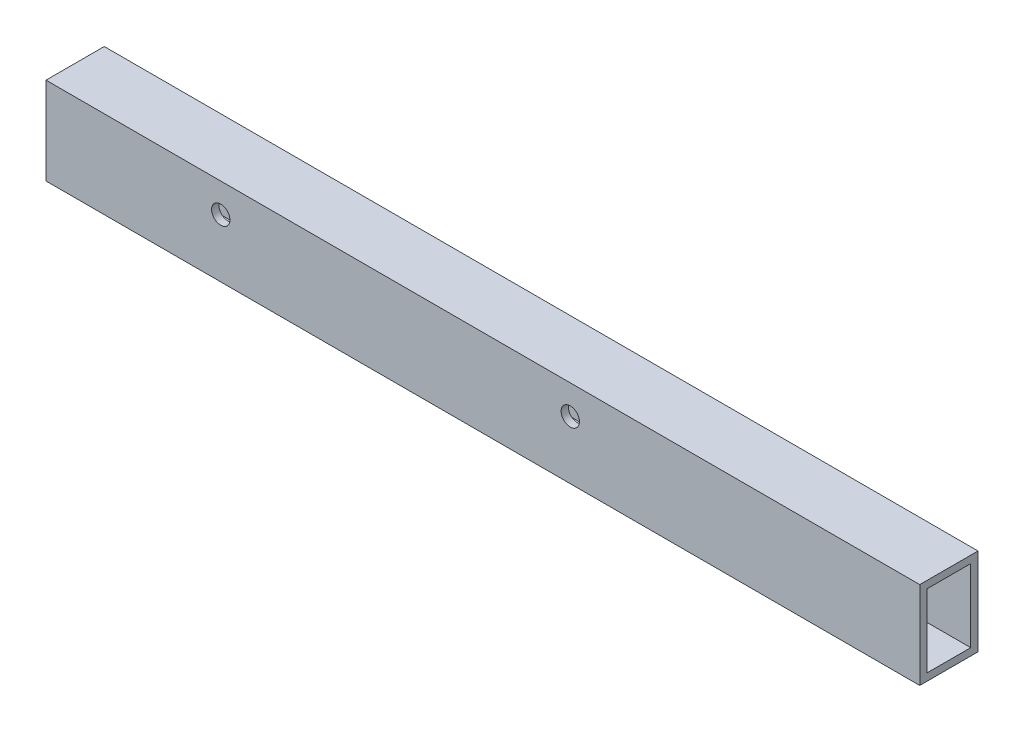
ISO-10303-21;
HEADER;
FILE_DESCRIPTION(('STEP AP214'),'2;1');
FILE_NAME('part.step','',(''),(''),'','','');
FILE_SCHEMA(('AUTOMOTIVE_DESIGN { 1 0 10303 214 1 1 1 1 }'));
ENDSEC;
DATA;
#1=APPLICATION_CONTEXT('core data for automotive mechanical design processes');
#2=APPLICATION_PROTOCOL_DEFINITION('international standard','automotive_design',2000,#1);
#3=PRODUCT_CONTEXT('',#1,'mechanical');
#4=PRODUCT('Part','Part','',(#3));
#5=PRODUCT_RELATED_PRODUCT_CATEGORY('part','',(#4));
#6=PRODUCT_DEFINITION_FORMATION('','',#4);
#7=PRODUCT_DEFINITION_CONTEXT('part definition',#1,'design');
#8=PRODUCT_DEFINITION('design','',#6,#7);
#9=PRODUCT_DEFINITION_SHAPE('','',#8);
#10=(LENGTH_UNIT() NAMED_UNIT(*) SI_UNIT(.MILLI.,.METRE.));
#11=(NAMED_UNIT(*) PLANE_ANGLE_UNIT() SI_UNIT($,.RADIAN.));
#12=(NAMED_UNIT(*) SI_UNIT($,.STERADIAN.) SOLID_ANGLE_UNIT());
#13=UNCERTAINTY_MEASURE_WITH_UNIT(LENGTH_MEASURE(1.E-05),#10,'distance_accuracy_value','');
#14=(GEOMETRIC_REPRESENTATION_CONTEXT(3) GLOBAL_UNCERTAINTY_ASSIGNED_CONTEXT((#13)) GLOBAL_UNIT_ASSIGNED_CONTEXT((#10,
#11,#12)) REPRESENTATION_CONTEXT('',''));
#15=CARTESIAN_POINT('',(0.,0.,0.));
#16=DIRECTION('',(0.,0.,1.));
#17=DIRECTION('',(1.,0.,0.));
#18=AXIS2_PLACEMENT_3D('',#15,#16,#17);
#19=CARTESIAN_POINT('',(381.,0.,0.));
#20=DIRECTION('',(-1.,0.,0.));
#21=DIRECTION('',(0.,0.,1.));
#22=AXIS2_PLACEMENT_3D('',#19,#20,#21);
#23=PLANE('',#22);
#24=DIRECTION('',(0.,1.,0.));
#25=VECTOR('',#24,1.);
#26=CARTESIAN_POINT('',(381.,-19.05,-12.7));
#27=LINE('',#26,#25);
#28=CARTESIAN_POINT('',(381.,-19.05,-12.7));
#29=VERTEX_POINT('',#28);
#30=CARTESIAN_POINT('',(381.,19.05,-12.7));
#31=VERTEX_POINT('',#30);
#32=EDGE_CURVE('E156',#29,#31,#27,.T.);
#33=ORIENTED_EDGE('',*,*,#32,.T.);
#34=DIRECTION('',(0.,0.,1.));
#35=VECTOR('',#34,1.);
#36=CARTESIAN_POINT('',(381.,19.05,12.7));
#37=LINE('',#36,#35);
#38=CARTESIAN_POINT('',(381.,19.05,12.7));
#39=VERTEX_POINT('',#38);
#40=EDGE_CURVE('E160',#31,#39,#37,.T.);
#41=ORIENTED_EDGE('',*,*,#40,.T.);
#42=DIRECTION('',(0.,-1.,0.));
#43=VECTOR('',#42,1.);
#44=CARTESIAN_POINT('',(381.,-19.05,12.7));
#45=LINE('',#44,#43);
#46=CARTESIAN_POINT('',(381.,-19.05,12.7));
#47=VERTEX_POINT('',#46);
#48=EDGE_CURVE('E164',#39,#47,#45,.T.);
#49=ORIENTED_EDGE('',*,*,#48,.T.);
#50=DIRECTION('',(0.,0.,-1.));
#51=VECTOR('',#50,1.);
#52=CARTESIAN_POINT('',(381.,-19.05,12.7));
#53=LINE('',#52,#51);
#54=EDGE_CURVE('E167',#47,#29,#53,.T.);
#55=ORIENTED_EDGE('',*,*,#54,.T.);
#56=EDGE_LOOP('',(#33,#41,#49,#55));
#57=FACE_BOUND('',#56,.T.);
#58=DIRECTION('',(0.,0.,-1.));
#59=VECTOR('',#58,1.);
#60=CARTESIAN_POINT('',(381.,-15.875,9.525));
#61=LINE('',#60,#59);
#62=CARTESIAN_POINT('',(381.,-15.875,9.525));
#63=VERTEX_POINT('',#62);
#64=CARTESIAN_POINT('',(381.,-15.875,-9.525));
#65=VERTEX_POINT('',#64);
#66=EDGE_CURVE('E106',#63,#65,#61,.T.);
#67=ORIENTED_EDGE('',*,*,#66,.F.);
#68=DIRECTION('',(0.,-1.,0.));
#69=VECTOR('',#68,1.);
#70=CARTESIAN_POINT('',(381.,-15.875,9.525));
#71=LINE('',#70,#69);
#72=CARTESIAN_POINT('',(381.,15.875,9.525));
#73=VERTEX_POINT('',#72);
#74=EDGE_CURVE('E132',#73,#63,#71,.T.);
#75=ORIENTED_EDGE('',*,*,#74,.F.);
#76=DIRECTION('',(0.,0.,1.));
#77=VECTOR('',#76,1.);
#78=CARTESIAN_POINT('',(381.,15.875,9.525));
#79=LINE('',#78,#77);
#80=CARTESIAN_POINT('',(381.,15.875,-9.525));
#81=VERTEX_POINT('',#80);
#82=EDGE_CURVE('E128',#81,#73,#79,.T.);
#83=ORIENTED_EDGE('',*,*,#82,.F.);
#84=DIRECTION('',(0.,1.,0.));
#85=VECTOR('',#84,1.);
#86=CARTESIAN_POINT('',(381.,-15.875,-9.525));
#87=LINE('',#86,#85);
#88=EDGE_CURVE('E115',#65,#81,#87,.T.);
#89=ORIENTED_EDGE('',*,*,#88,.F.);
#90=EDGE_LOOP('',(#67,#75,#83,#89));
#91=FACE_BOUND('',#90,.T.);
#92=ADVANCED_FACE('F38',(#57,#91),#23,.F.);
#93=CARTESIAN_POINT('',(0.,0.,0.));
#94=DIRECTION('',(-1.,0.,0.));
#95=DIRECTION('',(0.,0.,1.));
#96=AXIS2_PLACEMENT_3D('',#93,#94,#95);
#97=PLANE('',#96);
#98=DIRECTION('',(0.,1.,0.));
#99=VECTOR('',#98,1.);
#100=CARTESIAN_POINT('',(0.,-19.05,-12.7));
#101=LINE('',#100,#99);
#102=CARTESIAN_POINT('',(0.,-19.05,-12.7));
#103=VERTEX_POINT('',#102);
#104=CARTESIAN_POINT('',(0.,19.05,-12.7));
#105=VERTEX_POINT('',#104);
#106=EDGE_CURVE('E124',#103,#105,#101,.T.);
#107=ORIENTED_EDGE('',*,*,#106,.F.);
#108=DIRECTION('',(0.,0.,-1.));
#109=VECTOR('',#108,1.);
#110=CARTESIAN_POINT('',(0.,-19.05,12.7));
#111=LINE('',#110,#109);
#112=CARTESIAN_POINT('',(0.,-19.05,12.7));
#113=VERTEX_POINT('',#112);
#114=EDGE_CURVE('E161',#113,#103,#111,.T.);
#115=ORIENTED_EDGE('',*,*,#114,.F.);
#116=DIRECTION('',(0.,-1.,0.));
#117=VECTOR('',#116,1.);
#118=CARTESIAN_POINT('',(0.,-19.05,12.7));
#119=LINE('',#118,#117);
#120=CARTESIAN_POINT('',(0.,19.05,12.7));
#121=VERTEX_POINT('',#120);
#122=EDGE_CURVE('E177',#121,#113,#119,.T.);
#123=ORIENTED_EDGE('',*,*,#122,.F.);
#124=DIRECTION('',(0.,0.,1.));
#125=VECTOR('',#124,1.);
#126=CARTESIAN_POINT('',(0.,19.05,12.7));
#127=LINE('',#126,#125);
#128=EDGE_CURVE('E174',#105,#121,#127,.T.);
#129=ORIENTED_EDGE('',*,*,#128,.F.);
#130=EDGE_LOOP('',(#107,#115,#123,#129));
#131=FACE_BOUND('',#130,.T.);
#132=DIRECTION('',(0.,-1.,0.));
#133=VECTOR('',#132,1.);
#134=CARTESIAN_POINT('',(0.,-15.875,9.525));
#135=LINE('',#134,#133);
#136=CARTESIAN_POINT('',(0.,15.875,9.525));
#137=VERTEX_POINT('',#136);
#138=CARTESIAN_POINT('',(0.,-15.875,9.525));
#139=VERTEX_POINT('',#138);
#140=EDGE_CURVE('E116',#137,#139,#135,.T.);
#141=ORIENTED_EDGE('',*,*,#140,.T.);
#142=DIRECTION('',(0.,0.,-1.));
#143=VECTOR('',#142,1.);
#144=CARTESIAN_POINT('',(0.,-15.875,9.525));
#145=LINE('',#144,#143);
#146=CARTESIAN_POINT('',(0.,-15.875,-9.525));
#147=VERTEX_POINT('',#146);
#148=EDGE_CURVE('E64',#139,#147,#145,.T.);
#149=ORIENTED_EDGE('',*,*,#148,.T.);
#150=DIRECTION('',(0.,1.,0.));
#151=VECTOR('',#150,1.);
#152=CARTESIAN_POINT('',(0.,-15.875,-9.525));
#153=LINE('',#152,#151);
#154=CARTESIAN_POINT('',(0.,15.875,-9.525));
#155=VERTEX_POINT('',#154);
#156=EDGE_CURVE('E122',#147,#155,#153,.T.);
#157=ORIENTED_EDGE('',*,*,#156,.T.);
#158=DIRECTION('',(0.,0.,1.));
#159=VECTOR('',#158,1.);
#160=CARTESIAN_POINT('',(0.,15.875,9.525));
#161=LINE('',#160,#159);
#162=EDGE_CURVE('E143',#155,#137,#161,.T.);
#163=ORIENTED_EDGE('',*,*,#162,.T.);
#164=EDGE_LOOP('',(#141,#149,#157,#163));
#165=FACE_BOUND('',#164,.T.);
#166=ADVANCED_FACE('F237',(#131,#165),#97,.T.);
#167=CARTESIAN_POINT('',(381.,-19.05,-12.7));
#168=DIRECTION('',(0.,0.,1.));
#169=DIRECTION('',(1.,0.,0.));
#170=AXIS2_PLACEMENT_3D('',#167,#168,#169);
#171=PLANE('',#170);
#172=CARTESIAN_POINT('',(76.2,6.35,-12.7));
#173=DIRECTION('',(0.,0.,-1.));
#174=DIRECTION('',(-1.,0.,0.));
#175=AXIS2_PLACEMENT_3D('',#172,#173,#174);
#176=CIRCLE('',#175,4.00000000000001);
#177=CARTESIAN_POINT('',(72.2,6.35,-12.7));
#178=VERTEX_POINT('',#177);
#179=EDGE_CURVE('E203',#178,#178,#176,.T.);
#180=ORIENTED_EDGE('',*,*,#179,.F.);
#181=EDGE_LOOP('',(#180));
#182=FACE_BOUND('',#181,.T.);
#183=CARTESIAN_POINT('',(228.6,6.34999999999998,-12.7));
#184=DIRECTION('',(0.,0.,-1.));
#185=DIRECTION('',(-1.,0.,0.));
#186=AXIS2_PLACEMENT_3D('',#183,#184,#185);
#187=CIRCLE('',#186,3.99999999999999);
#188=CARTESIAN_POINT('',(224.6,6.34999999999998,-12.7));
#189=VERTEX_POINT('',#188);
#190=EDGE_CURVE('E215',#189,#189,#187,.T.);
#191=ORIENTED_EDGE('',*,*,#190,.F.);
#192=EDGE_LOOP('',(#191));
#193=FACE_BOUND('',#192,.T.);
#194=ORIENTED_EDGE('',*,*,#106,.T.);
#195=DIRECTION('',(-1.,0.,0.));
#196=VECTOR('',#195,1.);
#197=CARTESIAN_POINT('',(381.,19.05,-12.7));
#198=LINE('',#197,#196);
#199=EDGE_CURVE('E11',#31,#105,#198,.T.);
#200=ORIENTED_EDGE('',*,*,#199,.F.);
#201=ORIENTED_EDGE('',*,*,#32,.F.);
#202=DIRECTION('',(-1.,0.,0.));
#203=VECTOR('',#202,1.);
#204=CARTESIAN_POINT('',(381.,-19.05,-12.7));
#205=LINE('',#204,#203);
#206=EDGE_CURVE('E170',#29,#103,#205,.T.);
#207=ORIENTED_EDGE('',*,*,#206,.T.);
#208=EDGE_LOOP('',(#194,#200,#201,#207));
#209=FACE_BOUND('',#208,.T.);
#210=ADVANCED_FACE('F40',(#182,#193,#209),#171,.F.);
#211=CARTESIAN_POINT('',(381.,19.05,12.7));
#212=DIRECTION('',(0.,-1.,0.));
#213=DIRECTION('',(0.,0.,-1.));
#214=AXIS2_PLACEMENT_3D('',#211,#212,#213);
#215=PLANE('',#214);
#216=ORIENTED_EDGE('',*,*,#128,.T.);
#217=DIRECTION('',(-1.,0.,0.));
#218=VECTOR('',#217,1.);
#219=CARTESIAN_POINT('',(381.,19.05,12.7));
#220=LINE('',#219,#218);
#221=EDGE_CURVE('E48',#39,#121,#220,.T.);
#222=ORIENTED_EDGE('',*,*,#221,.F.);
#223=ORIENTED_EDGE('',*,*,#40,.F.);
#224=ORIENTED_EDGE('',*,*,#199,.T.);
#225=EDGE_LOOP('',(#216,#222,#223,#224));
#226=FACE_BOUND('',#225,.T.);
#227=ADVANCED_FACE('F264',(#226),#215,.F.);
#228=CARTESIAN_POINT('',(381.,-19.05,12.7));
#229=DIRECTION('',(0.,0.,-1.));
#230=DIRECTION('',(-1.,0.,0.));
#231=AXIS2_PLACEMENT_3D('',#228,#229,#230);
#232=PLANE('',#231);
#233=CARTESIAN_POINT('',(76.2,6.35,12.7));
#234=DIRECTION('',(0.,0.,-1.));
#235=DIRECTION('',(-1.,0.,0.));
#236=AXIS2_PLACEMENT_3D('',#233,#234,#235);
#237=CIRCLE('',#236,4.00000000000001);
#238=CARTESIAN_POINT('',(72.2,6.35,12.7));
#239=VERTEX_POINT('',#238);
#240=EDGE_CURVE('E195',#239,#239,#237,.T.);
#241=ORIENTED_EDGE('',*,*,#240,.T.);
#242=EDGE_LOOP('',(#241));
#243=FACE_BOUND('',#242,.T.);
#244=CARTESIAN_POINT('',(228.6,6.34999999999998,12.7));
#245=DIRECTION('',(0.,0.,-1.));
#246=DIRECTION('',(-1.,0.,0.));
#247=AXIS2_PLACEMENT_3D('',#244,#245,#246);
#248=CIRCLE('',#247,3.99999999999999);
#249=CARTESIAN_POINT('',(224.6,6.34999999999998,12.7));
#250=VERTEX_POINT('',#249);
#251=EDGE_CURVE('E209',#250,#250,#248,.T.);
#252=ORIENTED_EDGE('',*,*,#251,.T.);
#253=EDGE_LOOP('',(#252));
#254=FACE_BOUND('',#253,.T.);
#255=ORIENTED_EDGE('',*,*,#122,.T.);
#256=DIRECTION('',(-1.,0.,0.));
#257=VECTOR('',#256,1.);
#258=CARTESIAN_POINT('',(381.,-19.05,12.7));
#259=LINE('',#258,#257);
#260=EDGE_CURVE('E185',#47,#113,#259,.T.);
#261=ORIENTED_EDGE('',*,*,#260,.F.);
#262=ORIENTED_EDGE('',*,*,#48,.F.);
#263=ORIENTED_EDGE('',*,*,#221,.T.);
#264=EDGE_LOOP('',(#255,#261,#262,#263));
#265=FACE_BOUND('',#264,.T.);
#266=ADVANCED_FACE('F261',(#243,#254,#265),#232,.F.);
#267=CARTESIAN_POINT('',(381.,-19.05,12.7));
#268=DIRECTION('',(0.,1.,0.));
#269=DIRECTION('',(0.,0.,1.));
#270=AXIS2_PLACEMENT_3D('',#267,#268,#269);
#271=PLANE('',#270);
#272=ORIENTED_EDGE('',*,*,#114,.T.);
#273=ORIENTED_EDGE('',*,*,#206,.F.);
#274=ORIENTED_EDGE('',*,*,#54,.F.);
#275=ORIENTED_EDGE('',*,*,#260,.T.);
#276=EDGE_LOOP('',(#272,#273,#274,#275));
#277=FACE_BOUND('',#276,.T.);
#278=ADVANCED_FACE('F258',(#277),#271,.F.);
#279=CARTESIAN_POINT('',(381.,-15.875,9.525));
#280=DIRECTION('',(0.,1.,0.));
#281=DIRECTION('',(0.,0.,1.));
#282=AXIS2_PLACEMENT_3D('',#279,#280,#281);
#283=PLANE('',#282);
#284=ORIENTED_EDGE('',*,*,#148,.F.);
#285=DIRECTION('',(-1.,0.,0.));
#286=VECTOR('',#285,1.);
#287=CARTESIAN_POINT('',(381.,-15.875,9.525));
#288=LINE('',#287,#286);
#289=EDGE_CURVE('E110',#63,#139,#288,.T.);
#290=ORIENTED_EDGE('',*,*,#289,.F.);
#291=ORIENTED_EDGE('',*,*,#66,.T.);
#292=DIRECTION('',(-1.,0.,0.));
#293=VECTOR('',#292,1.);
#294=CARTESIAN_POINT('',(381.,-15.875,-9.525));
#295=LINE('',#294,#293);
#296=EDGE_CURVE('E109',#65,#147,#295,.T.);
#297=ORIENTED_EDGE('',*,*,#296,.T.);
#298=EDGE_LOOP('',(#284,#290,#291,#297));
#299=FACE_BOUND('',#298,.T.);
#300=ADVANCED_FACE('F108',(#299),#283,.T.);
#301=CARTESIAN_POINT('',(381.,-15.875,-9.525));
#302=DIRECTION('',(0.,0.,1.));
#303=DIRECTION('',(1.,0.,0.));
#304=AXIS2_PLACEMENT_3D('',#301,#302,#303);
#305=PLANE('',#304);
#306=CARTESIAN_POINT('',(76.2,6.35,-9.525));
#307=DIRECTION('',(0.,0.,1.));
#308=DIRECTION('',(1.,0.,0.));
#309=AXIS2_PLACEMENT_3D('',#306,#307,#308);
#310=CIRCLE('',#309,4.00000000000001);
#311=CARTESIAN_POINT('',(80.2,6.35,-9.525));
#312=VERTEX_POINT('',#311);
#313=EDGE_CURVE('E140',#312,#312,#310,.T.);
#314=ORIENTED_EDGE('',*,*,#313,.F.);
#315=EDGE_LOOP('',(#314));
#316=FACE_BOUND('',#315,.T.);
#317=CARTESIAN_POINT('',(228.6,6.34999999999998,-9.525));
#318=DIRECTION('',(0.,0.,1.));
#319=DIRECTION('',(1.,0.,0.));
#320=AXIS2_PLACEMENT_3D('',#317,#318,#319);
#321=CIRCLE('',#320,3.99999999999999);
#322=CARTESIAN_POINT('',(232.6,6.34999999999998,-9.525));
#323=VERTEX_POINT('',#322);
#324=EDGE_CURVE('E194',#323,#323,#321,.T.);
#325=ORIENTED_EDGE('',*,*,#324,.F.);
#326=EDGE_LOOP('',(#325));
#327=FACE_BOUND('',#326,.T.);
#328=ORIENTED_EDGE('',*,*,#156,.F.);
#329=ORIENTED_EDGE('',*,*,#296,.F.);
#330=ORIENTED_EDGE('',*,*,#88,.T.);
#331=DIRECTION('',(-1.,0.,0.));
#332=VECTOR('',#331,1.);
#333=CARTESIAN_POINT('',(381.,15.875,-9.525));
#334=LINE('',#333,#332);
#335=EDGE_CURVE('E125',#81,#155,#334,.T.);
#336=ORIENTED_EDGE('',*,*,#335,.T.);
#337=EDGE_LOOP('',(#328,#329,#330,#336));
#338=FACE_BOUND('',#337,.T.);
#339=ADVANCED_FACE('F119',(#316,#327,#338),#305,.T.);
#340=CARTESIAN_POINT('',(381.,15.875,9.525));
#341=DIRECTION('',(0.,-1.,0.));
#342=DIRECTION('',(0.,0.,-1.));
#343=AXIS2_PLACEMENT_3D('',#340,#341,#342);
#344=PLANE('',#343);
#345=ORIENTED_EDGE('',*,*,#162,.F.);
#346=ORIENTED_EDGE('',*,*,#335,.F.);
#347=ORIENTED_EDGE('',*,*,#82,.T.);
#348=DIRECTION('',(-1.,0.,0.));
#349=VECTOR('',#348,1.);
#350=CARTESIAN_POINT('',(381.,15.875,9.525));
#351=LINE('',#350,#349);
#352=EDGE_CURVE('E56',#73,#137,#351,.T.);
#353=ORIENTED_EDGE('',*,*,#352,.T.);
#354=EDGE_LOOP('',(#345,#346,#347,#353));
#355=FACE_BOUND('',#354,.T.);
#356=ADVANCED_FACE('F233',(#355),#344,.T.);
#357=CARTESIAN_POINT('',(381.,-15.875,9.525));
#358=DIRECTION('',(0.,0.,-1.));
#359=DIRECTION('',(-1.,0.,0.));
#360=AXIS2_PLACEMENT_3D('',#357,#358,#359);
#361=PLANE('',#360);
#362=CARTESIAN_POINT('',(76.2,6.35,9.525));
#363=DIRECTION('',(0.,0.,-1.));
#364=DIRECTION('',(-1.,0.,0.));
#365=AXIS2_PLACEMENT_3D('',#362,#363,#364);
#366=CIRCLE('',#365,4.00000000000001);
#367=CARTESIAN_POINT('',(72.2,6.35,9.525));
#368=VERTEX_POINT('',#367);
#369=EDGE_CURVE('E42',#368,#368,#366,.T.);
#370=ORIENTED_EDGE('',*,*,#369,.F.);
#371=EDGE_LOOP('',(#370));
#372=FACE_BOUND('',#371,.T.);
#373=CARTESIAN_POINT('',(228.6,6.34999999999998,9.525));
#374=DIRECTION('',(0.,0.,-1.));
#375=DIRECTION('',(-1.,0.,0.));
#376=AXIS2_PLACEMENT_3D('',#373,#374,#375);
#377=CIRCLE('',#376,3.99999999999999);
#378=CARTESIAN_POINT('',(224.6,6.34999999999998,9.525));
#379=VERTEX_POINT('',#378);
#380=EDGE_CURVE('E191',#379,#379,#377,.T.);
#381=ORIENTED_EDGE('',*,*,#380,.F.);
#382=EDGE_LOOP('',(#381));
#383=FACE_BOUND('',#382,.T.);
#384=ORIENTED_EDGE('',*,*,#140,.F.);
#385=ORIENTED_EDGE('',*,*,#352,.F.);
#386=ORIENTED_EDGE('',*,*,#74,.T.);
#387=ORIENTED_EDGE('',*,*,#289,.T.);
#388=EDGE_LOOP('',(#384,#385,#386,#387));
#389=FACE_BOUND('',#388,.T.);
#390=ADVANCED_FACE('F229',(#372,#383,#389),#361,.T.);
#391=CARTESIAN_POINT('',(228.6,6.34999999999998,12.7));
#392=DIRECTION('',(0.,0.,-1.));
#393=DIRECTION('',(-1.,0.,0.));
#394=AXIS2_PLACEMENT_3D('',#391,#392,#393);
#395=CYLINDRICAL_SURFACE('',#394,3.99999999999999);
#396=ORIENTED_EDGE('',*,*,#380,.T.);
#397=EDGE_LOOP('',(#396));
#398=FACE_BOUND('',#397,.T.);
#399=ORIENTED_EDGE('',*,*,#251,.F.);
#400=EDGE_LOOP('',(#399));
#401=FACE_BOUND('',#400,.T.);
#402=ADVANCED_FACE('F232',(#398,#401),#395,.F.);
#403=CARTESIAN_POINT('',(76.2,6.35,12.7));
#404=DIRECTION('',(0.,0.,-1.));
#405=DIRECTION('',(-1.,0.,0.));
#406=AXIS2_PLACEMENT_3D('',#403,#404,#405);
#407=CYLINDRICAL_SURFACE('',#406,4.00000000000001);
#408=ORIENTED_EDGE('',*,*,#369,.T.);
#409=EDGE_LOOP('',(#408));
#410=FACE_BOUND('',#409,.T.);
#411=ORIENTED_EDGE('',*,*,#240,.F.);
#412=EDGE_LOOP('',(#411));
#413=FACE_BOUND('',#412,.T.);
#414=ADVANCED_FACE('F226',(#410,#413),#407,.F.);
#415=ORIENTED_EDGE('',*,*,#324,.T.);
#416=EDGE_LOOP('',(#415));
#417=FACE_BOUND('',#416,.T.);
#418=ORIENTED_EDGE('',*,*,#190,.T.);
#419=EDGE_LOOP('',(#418));
#420=FACE_BOUND('',#419,.T.);
#421=ADVANCED_FACE('F290',(#417,#420),#395,.F.);
#422=ORIENTED_EDGE('',*,*,#313,.T.);
#423=EDGE_LOOP('',(#422));
#424=FACE_BOUND('',#423,.T.);
#425=ORIENTED_EDGE('',*,*,#179,.T.);
#426=EDGE_LOOP('',(#425));
#427=FACE_BOUND('',#426,.T.);
#428=ADVANCED_FACE('F292',(#424,#427),#407,.F.);
#429=CLOSED_SHELL('',(#92,#166,#210,#227,#266,#278,#300,#339,#356,#390,#402,#414,#421,#428));
#430=MANIFOLD_SOLID_BREP('B2',#429);
#431=ADVANCED_BREP_SHAPE_REPRESENTATION('',(#18,#430),#14);
#432=SHAPE_DEFINITION_REPRESENTATION(#9,#431);
ENDSEC;
END-ISO-10303-21;
